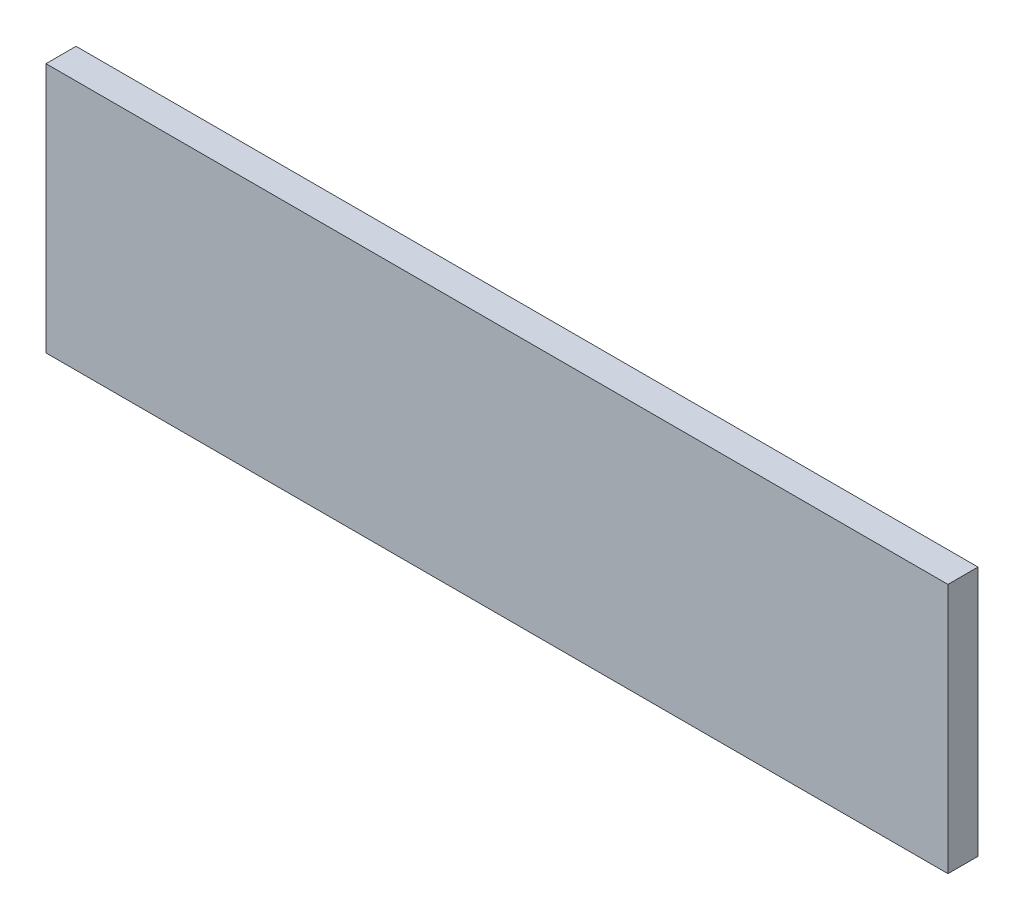
ISO-10303-21;
HEADER;
FILE_DESCRIPTION(('STEP AP214'),'2;1');
FILE_NAME('part.step','',(''),(''),'','','');
FILE_SCHEMA(('AUTOMOTIVE_DESIGN { 1 0 10303 214 1 1 1 1 }'));
ENDSEC;
DATA;
#1=APPLICATION_CONTEXT('core data for automotive mechanical design processes');
#2=APPLICATION_PROTOCOL_DEFINITION('international standard','automotive_design',2000,#1);
#3=PRODUCT_CONTEXT('',#1,'mechanical');
#4=PRODUCT('Part','Part','',(#3));
#5=PRODUCT_RELATED_PRODUCT_CATEGORY('part','',(#4));
#6=PRODUCT_DEFINITION_FORMATION('','',#4);
#7=PRODUCT_DEFINITION_CONTEXT('part definition',#1,'design');
#8=PRODUCT_DEFINITION('design','',#6,#7);
#9=PRODUCT_DEFINITION_SHAPE('','',#8);
#10=(LENGTH_UNIT() NAMED_UNIT(*) SI_UNIT(.MILLI.,.METRE.));
#11=(NAMED_UNIT(*) PLANE_ANGLE_UNIT() SI_UNIT($,.RADIAN.));
#12=(NAMED_UNIT(*) SI_UNIT($,.STERADIAN.) SOLID_ANGLE_UNIT());
#13=UNCERTAINTY_MEASURE_WITH_UNIT(LENGTH_MEASURE(1.E-05),#10,'distance_accuracy_value','');
#14=(GEOMETRIC_REPRESENTATION_CONTEXT(3) GLOBAL_UNCERTAINTY_ASSIGNED_CONTEXT((#13)) GLOBAL_UNIT_ASSIGNED_CONTEXT((#10,
#11,#12)) REPRESENTATION_CONTEXT('',''));
#15=CARTESIAN_POINT('',(0.,0.,0.));
#16=DIRECTION('',(0.,0.,1.));
#17=DIRECTION('',(1.,0.,0.));
#18=AXIS2_PLACEMENT_3D('',#15,#16,#17);
#19=CARTESIAN_POINT('',(45.,12.5,3.));
#20=DIRECTION('',(-1.,0.,0.));
#21=DIRECTION('',(0.,-1.,0.));
#22=AXIS2_PLACEMENT_3D('',#19,#20,#21);
#23=PLANE('',#22);
#24=DIRECTION('',(0.,1.,0.));
#25=VECTOR('',#24,1.);
#26=CARTESIAN_POINT('',(45.,12.5,0.));
#27=LINE('',#26,#25);
#28=CARTESIAN_POINT('',(45.,-12.5,0.));
#29=VERTEX_POINT('',#28);
#30=CARTESIAN_POINT('',(45.,12.5,0.));
#31=VERTEX_POINT('',#30);
#32=EDGE_CURVE('E96',#29,#31,#27,.T.);
#33=ORIENTED_EDGE('',*,*,#32,.T.);
#34=DIRECTION('',(0.,0.,-1.));
#35=VECTOR('',#34,1.);
#36=CARTESIAN_POINT('',(45.,12.5,3.));
#37=LINE('',#36,#35);
#38=CARTESIAN_POINT('',(45.,12.5,3.));
#39=VERTEX_POINT('',#38);
#40=EDGE_CURVE('E11',#39,#31,#37,.T.);
#41=ORIENTED_EDGE('',*,*,#40,.F.);
#42=DIRECTION('',(0.,1.,0.));
#43=VECTOR('',#42,1.);
#44=CARTESIAN_POINT('',(45.,12.5,3.));
#45=LINE('',#44,#43);
#46=CARTESIAN_POINT('',(45.,-12.5,3.));
#47=VERTEX_POINT('',#46);
#48=EDGE_CURVE('E84',#47,#39,#45,.T.);
#49=ORIENTED_EDGE('',*,*,#48,.F.);
#50=DIRECTION('',(0.,0.,-1.));
#51=VECTOR('',#50,1.);
#52=CARTESIAN_POINT('',(45.,-12.5,3.));
#53=LINE('',#52,#51);
#54=EDGE_CURVE('E92',#47,#29,#53,.T.);
#55=ORIENTED_EDGE('',*,*,#54,.T.);
#56=EDGE_LOOP('',(#33,#41,#49,#55));
#57=FACE_BOUND('',#56,.T.);
#58=ADVANCED_FACE('F33',(#57),#23,.F.);
#59=CARTESIAN_POINT('',(-45.,12.5,3.));
#60=DIRECTION('',(0.,-1.,0.));
#61=DIRECTION('',(0.,0.,-1.));
#62=AXIS2_PLACEMENT_3D('',#59,#60,#61);
#63=PLANE('',#62);
#64=DIRECTION('',(-1.,0.,0.));
#65=VECTOR('',#64,1.);
#66=CARTESIAN_POINT('',(-45.,12.5,0.));
#67=LINE('',#66,#65);
#68=CARTESIAN_POINT('',(-45.,12.5,0.));
#69=VERTEX_POINT('',#68);
#70=EDGE_CURVE('E88',#31,#69,#67,.T.);
#71=ORIENTED_EDGE('',*,*,#70,.T.);
#72=DIRECTION('',(0.,0.,-1.));
#73=VECTOR('',#72,1.);
#74=CARTESIAN_POINT('',(-45.,12.5,3.));
#75=LINE('',#74,#73);
#76=CARTESIAN_POINT('',(-45.,12.5,3.));
#77=VERTEX_POINT('',#76);
#78=EDGE_CURVE('E41',#77,#69,#75,.T.);
#79=ORIENTED_EDGE('',*,*,#78,.F.);
#80=DIRECTION('',(-1.,0.,0.));
#81=VECTOR('',#80,1.);
#82=CARTESIAN_POINT('',(-45.,12.5,3.));
#83=LINE('',#82,#81);
#84=EDGE_CURVE('E79',#39,#77,#83,.T.);
#85=ORIENTED_EDGE('',*,*,#84,.F.);
#86=ORIENTED_EDGE('',*,*,#40,.T.);
#87=EDGE_LOOP('',(#71,#79,#85,#86));
#88=FACE_BOUND('',#87,.T.);
#89=ADVANCED_FACE('F87',(#88),#63,.F.);
#90=CARTESIAN_POINT('',(-45.,12.5,3.));
#91=DIRECTION('',(1.,0.,0.));
#92=DIRECTION('',(0.,0.,-1.));
#93=AXIS2_PLACEMENT_3D('',#90,#91,#92);
#94=PLANE('',#93);
#95=DIRECTION('',(0.,-1.,0.));
#96=VECTOR('',#95,1.);
#97=CARTESIAN_POINT('',(-45.,12.5,0.));
#98=LINE('',#97,#96);
#99=CARTESIAN_POINT('',(-45.,-12.5,0.));
#100=VERTEX_POINT('',#99);
#101=EDGE_CURVE('E66',#69,#100,#98,.T.);
#102=ORIENTED_EDGE('',*,*,#101,.T.);
#103=DIRECTION('',(0.,0.,-1.));
#104=VECTOR('',#103,1.);
#105=CARTESIAN_POINT('',(-45.,-12.5,3.));
#106=LINE('',#105,#104);
#107=CARTESIAN_POINT('',(-45.,-12.5,3.));
#108=VERTEX_POINT('',#107);
#109=EDGE_CURVE('E89',#108,#100,#106,.T.);
#110=ORIENTED_EDGE('',*,*,#109,.F.);
#111=DIRECTION('',(0.,-1.,0.));
#112=VECTOR('',#111,1.);
#113=CARTESIAN_POINT('',(-45.,12.5,3.));
#114=LINE('',#113,#112);
#115=EDGE_CURVE('E82',#77,#108,#114,.T.);
#116=ORIENTED_EDGE('',*,*,#115,.F.);
#117=ORIENTED_EDGE('',*,*,#78,.T.);
#118=EDGE_LOOP('',(#102,#110,#116,#117));
#119=FACE_BOUND('',#118,.T.);
#120=ADVANCED_FACE('F90',(#119),#94,.F.);
#121=CARTESIAN_POINT('',(-45.,-12.5,3.));
#122=DIRECTION('',(0.,1.,0.));
#123=DIRECTION('',(0.,0.,1.));
#124=AXIS2_PLACEMENT_3D('',#121,#122,#123);
#125=PLANE('',#124);
#126=DIRECTION('',(1.,0.,0.));
#127=VECTOR('',#126,1.);
#128=CARTESIAN_POINT('',(-45.,-12.5,0.));
#129=LINE('',#128,#127);
#130=EDGE_CURVE('E72',#100,#29,#129,.T.);
#131=ORIENTED_EDGE('',*,*,#130,.T.);
#132=ORIENTED_EDGE('',*,*,#54,.F.);
#133=DIRECTION('',(1.,0.,0.));
#134=VECTOR('',#133,1.);
#135=CARTESIAN_POINT('',(-45.,-12.5,3.));
#136=LINE('',#135,#134);
#137=EDGE_CURVE('E49',#108,#47,#136,.T.);
#138=ORIENTED_EDGE('',*,*,#137,.F.);
#139=ORIENTED_EDGE('',*,*,#109,.T.);
#140=EDGE_LOOP('',(#131,#132,#138,#139));
#141=FACE_BOUND('',#140,.T.);
#142=ADVANCED_FACE('F103',(#141),#125,.F.);
#143=CARTESIAN_POINT('',(0.,0.,3.));
#144=DIRECTION('',(0.,0.,1.));
#145=DIRECTION('',(1.,0.,0.));
#146=AXIS2_PLACEMENT_3D('',#143,#144,#145);
#147=PLANE('',#146);
#148=ORIENTED_EDGE('',*,*,#48,.T.);
#149=ORIENTED_EDGE('',*,*,#84,.T.);
#150=ORIENTED_EDGE('',*,*,#115,.T.);
#151=ORIENTED_EDGE('',*,*,#137,.T.);
#152=EDGE_LOOP('',(#148,#149,#150,#151));
#153=FACE_BOUND('',#152,.T.);
#154=ADVANCED_FACE('F80',(#153),#147,.T.);
#155=CARTESIAN_POINT('',(0.,0.,0.));
#156=DIRECTION('',(0.,0.,1.));
#157=DIRECTION('',(1.,0.,0.));
#158=AXIS2_PLACEMENT_3D('',#155,#156,#157);
#159=PLANE('',#158);
#160=ORIENTED_EDGE('',*,*,#32,.F.);
#161=ORIENTED_EDGE('',*,*,#130,.F.);
#162=ORIENTED_EDGE('',*,*,#101,.F.);
#163=ORIENTED_EDGE('',*,*,#70,.F.);
#164=EDGE_LOOP('',(#160,#161,#162,#163));
#165=FACE_BOUND('',#164,.T.);
#166=ADVANCED_FACE('F106',(#165),#159,.F.);
#167=CLOSED_SHELL('',(#58,#89,#120,#142,#154,#166));
#168=MANIFOLD_SOLID_BREP('B2',#167);
#169=ADVANCED_BREP_SHAPE_REPRESENTATION('',(#18,#168),#14);
#170=SHAPE_DEFINITION_REPRESENTATION(#9,#169);
ENDSEC;
END-ISO-10303-21;
